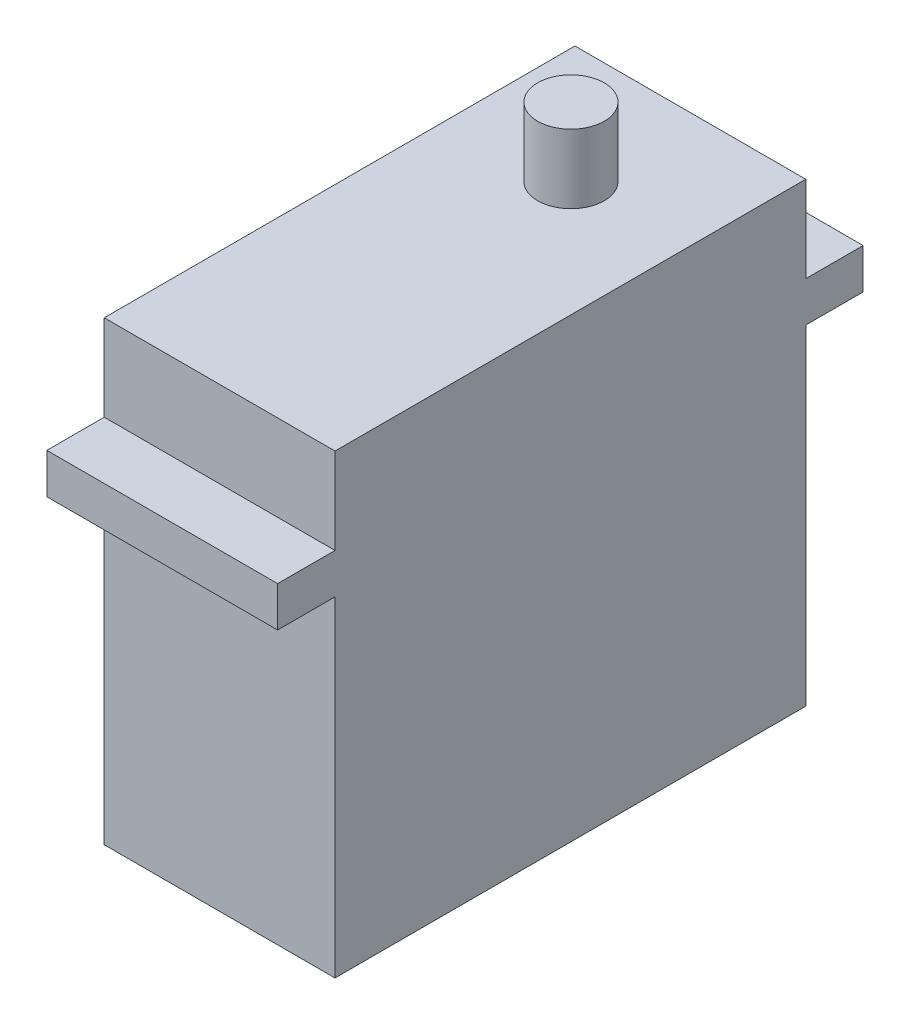
ISO-10303-21;
HEADER;
FILE_DESCRIPTION(('STEP AP214'),'2;1');
FILE_NAME('part.step','',(''),(''),'','','');
FILE_SCHEMA(('AUTOMOTIVE_DESIGN { 1 0 10303 214 1 1 1 1 }'));
ENDSEC;
DATA;
#1=APPLICATION_CONTEXT('core data for automotive mechanical design processes');
#2=APPLICATION_PROTOCOL_DEFINITION('international standard','automotive_design',2000,#1);
#3=PRODUCT_CONTEXT('',#1,'mechanical');
#4=PRODUCT('Part','Part','',(#3));
#5=PRODUCT_RELATED_PRODUCT_CATEGORY('part','',(#4));
#6=PRODUCT_DEFINITION_FORMATION('','',#4);
#7=PRODUCT_DEFINITION_CONTEXT('part definition',#1,'design');
#8=PRODUCT_DEFINITION('design','',#6,#7);
#9=PRODUCT_DEFINITION_SHAPE('','',#8);
#10=(LENGTH_UNIT() NAMED_UNIT(*) SI_UNIT(.MILLI.,.METRE.));
#11=(NAMED_UNIT(*) PLANE_ANGLE_UNIT() SI_UNIT($,.RADIAN.));
#12=(NAMED_UNIT(*) SI_UNIT($,.STERADIAN.) SOLID_ANGLE_UNIT());
#13=UNCERTAINTY_MEASURE_WITH_UNIT(LENGTH_MEASURE(1.E-05),#10,'distance_accuracy_value','');
#14=(GEOMETRIC_REPRESENTATION_CONTEXT(3) GLOBAL_UNCERTAINTY_ASSIGNED_CONTEXT((#13)) GLOBAL_UNIT_ASSIGNED_CONTEXT((#10,
#11,#12)) REPRESENTATION_CONTEXT('',''));
#15=CARTESIAN_POINT('',(0.,0.,0.));
#16=DIRECTION('',(0.,0.,1.));
#17=DIRECTION('',(1.,0.,0.));
#18=AXIS2_PLACEMENT_3D('',#15,#16,#17);
#19=CARTESIAN_POINT('',(20.1,0.,0.));
#20=DIRECTION('',(1.,0.,0.));
#21=DIRECTION('',(0.,0.,-1.));
#22=AXIS2_PLACEMENT_3D('',#19,#20,#21);
#23=PLANE('',#22);
#24=DIRECTION('',(0.,0.,-1.));
#25=VECTOR('',#24,1.);
#26=CARTESIAN_POINT('',(20.1,19.875,0.));
#27=LINE('',#26,#25);
#28=CARTESIAN_POINT('',(20.1,19.875,20.5));
#29=VERTEX_POINT('',#28);
#30=CARTESIAN_POINT('',(20.1,19.875,-20.5));
#31=VERTEX_POINT('',#30);
#32=EDGE_CURVE('E234',#29,#31,#27,.T.);
#33=ORIENTED_EDGE('',*,*,#32,.F.);
#34=DIRECTION('',(0.,-1.,0.));
#35=VECTOR('',#34,1.);
#36=CARTESIAN_POINT('',(20.1,0.,20.5));
#37=LINE('',#36,#35);
#38=CARTESIAN_POINT('',(20.1,12.375,20.5));
#39=VERTEX_POINT('',#38);
#40=EDGE_CURVE('E225',#29,#39,#37,.T.);
#41=ORIENTED_EDGE('',*,*,#40,.T.);
#42=DIRECTION('',(0.,0.,1.));
#43=VECTOR('',#42,1.);
#44=CARTESIAN_POINT('',(20.1,12.375,0.));
#45=LINE('',#44,#43);
#46=CARTESIAN_POINT('',(20.1,12.375,25.5));
#47=VERTEX_POINT('',#46);
#48=EDGE_CURVE('E301',#39,#47,#45,.T.);
#49=ORIENTED_EDGE('',*,*,#48,.T.);
#50=DIRECTION('',(0.,-1.,0.));
#51=VECTOR('',#50,1.);
#52=CARTESIAN_POINT('',(20.1,0.,25.5));
#53=LINE('',#52,#51);
#54=CARTESIAN_POINT('',(20.1,8.87500000000001,25.5));
#55=VERTEX_POINT('',#54);
#56=EDGE_CURVE('E297',#47,#55,#53,.T.);
#57=ORIENTED_EDGE('',*,*,#56,.T.);
#58=DIRECTION('',(0.,0.,1.));
#59=VECTOR('',#58,1.);
#60=CARTESIAN_POINT('',(20.1,8.87500000000004,0.));
#61=LINE('',#60,#59);
#62=CARTESIAN_POINT('',(20.1,8.87500000000001,20.5));
#63=VERTEX_POINT('',#62);
#64=EDGE_CURVE('E291',#63,#55,#61,.T.);
#65=ORIENTED_EDGE('',*,*,#64,.F.);
#66=CARTESIAN_POINT('',(20.1,-19.875,20.5));
#67=VERTEX_POINT('',#66);
#68=EDGE_CURVE('E286',#63,#67,#37,.T.);
#69=ORIENTED_EDGE('',*,*,#68,.T.);
#70=DIRECTION('',(0.,0.,-1.));
#71=VECTOR('',#70,1.);
#72=CARTESIAN_POINT('',(20.1,-19.875,0.));
#73=LINE('',#72,#71);
#74=CARTESIAN_POINT('',(20.1,-19.875,-20.5));
#75=VERTEX_POINT('',#74);
#76=EDGE_CURVE('E283',#67,#75,#73,.T.);
#77=ORIENTED_EDGE('',*,*,#76,.T.);
#78=DIRECTION('',(0.,-1.,0.));
#79=VECTOR('',#78,1.);
#80=CARTESIAN_POINT('',(20.1,0.,-20.5));
#81=LINE('',#80,#79);
#82=CARTESIAN_POINT('',(20.1,8.87500000000001,-20.5));
#83=VERTEX_POINT('',#82);
#84=EDGE_CURVE('E157',#83,#75,#81,.T.);
#85=ORIENTED_EDGE('',*,*,#84,.F.);
#86=DIRECTION('',(0.,0.,-1.));
#87=VECTOR('',#86,1.);
#88=CARTESIAN_POINT('',(20.1,8.87500000000004,0.));
#89=LINE('',#88,#87);
#90=CARTESIAN_POINT('',(20.1,8.87500000000001,-25.5));
#91=VERTEX_POINT('',#90);
#92=EDGE_CURVE('E151',#83,#91,#89,.T.);
#93=ORIENTED_EDGE('',*,*,#92,.T.);
#94=DIRECTION('',(0.,-1.,0.));
#95=VECTOR('',#94,1.);
#96=CARTESIAN_POINT('',(20.1,0.,-25.5));
#97=LINE('',#96,#95);
#98=CARTESIAN_POINT('',(20.1,12.375,-25.5));
#99=VERTEX_POINT('',#98);
#100=EDGE_CURVE('E155',#99,#91,#97,.T.);
#101=ORIENTED_EDGE('',*,*,#100,.F.);
#102=DIRECTION('',(0.,0.,-1.));
#103=VECTOR('',#102,1.);
#104=CARTESIAN_POINT('',(20.1,12.375,0.));
#105=LINE('',#104,#103);
#106=CARTESIAN_POINT('',(20.1,12.375,-20.5));
#107=VERTEX_POINT('',#106);
#108=EDGE_CURVE('E170',#107,#99,#105,.T.);
#109=ORIENTED_EDGE('',*,*,#108,.F.);
#110=EDGE_CURVE('E201',#31,#107,#81,.T.);
#111=ORIENTED_EDGE('',*,*,#110,.F.);
#112=EDGE_LOOP('',(#33,#41,#49,#57,#65,#69,#77,#85,#93,#101,#109,#111));
#113=FACE_BOUND('',#112,.T.);
#114=ADVANCED_FACE('F58',(#113),#23,.T.);
#115=CARTESIAN_POINT('',(20.1,25.875,0.));
#116=DIRECTION('',(0.,1.,0.));
#117=DIRECTION('',(0.,0.,1.));
#118=AXIS2_PLACEMENT_3D('',#115,#116,#117);
#119=PLANE('',#118);
#120=CARTESIAN_POINT('',(10.05,25.875,-10.1));
#121=DIRECTION('',(0.,1.,0.));
#122=DIRECTION('',(0.,0.,1.));
#123=AXIS2_PLACEMENT_3D('',#120,#121,#122);
#124=CIRCLE('',#123,2.9);
#125=CARTESIAN_POINT('',(10.05,25.875,-7.19999999999999));
#126=VERTEX_POINT('',#125);
#127=EDGE_CURVE('E178',#126,#126,#124,.T.);
#128=ORIENTED_EDGE('',*,*,#127,.T.);
#129=EDGE_LOOP('',(#128));
#130=FACE_BOUND('',#129,.T.);
#131=ADVANCED_FACE('F60',(#130),#119,.T.);
#132=CARTESIAN_POINT('',(0.,0.,0.));
#133=DIRECTION('',(1.,0.,0.));
#134=DIRECTION('',(0.,0.,-1.));
#135=AXIS2_PLACEMENT_3D('',#132,#133,#134);
#136=PLANE('',#135);
#137=DIRECTION('',(0.,0.,-1.));
#138=VECTOR('',#137,1.);
#139=CARTESIAN_POINT('',(0.,19.875,0.));
#140=LINE('',#139,#138);
#141=CARTESIAN_POINT('',(0.,19.875,20.5));
#142=VERTEX_POINT('',#141);
#143=CARTESIAN_POINT('',(0.,19.875,-20.5));
#144=VERTEX_POINT('',#143);
#145=EDGE_CURVE('E177',#142,#144,#140,.T.);
#146=ORIENTED_EDGE('',*,*,#145,.T.);
#147=DIRECTION('',(0.,-1.,0.));
#148=VECTOR('',#147,1.);
#149=CARTESIAN_POINT('',(0.,0.,-20.5));
#150=LINE('',#149,#148);
#151=CARTESIAN_POINT('',(0.,12.375,-20.5));
#152=VERTEX_POINT('',#151);
#153=EDGE_CURVE('E175',#144,#152,#150,.T.);
#154=ORIENTED_EDGE('',*,*,#153,.T.);
#155=DIRECTION('',(0.,0.,-1.));
#156=VECTOR('',#155,1.);
#157=CARTESIAN_POINT('',(0.,12.375,0.));
#158=LINE('',#157,#156);
#159=CARTESIAN_POINT('',(0.,12.375,-25.5));
#160=VERTEX_POINT('',#159);
#161=EDGE_CURVE('E198',#152,#160,#158,.T.);
#162=ORIENTED_EDGE('',*,*,#161,.T.);
#163=DIRECTION('',(0.,-1.,0.));
#164=VECTOR('',#163,1.);
#165=CARTESIAN_POINT('',(0.,0.,-25.5));
#166=LINE('',#165,#164);
#167=CARTESIAN_POINT('',(0.,8.87500000000001,-25.5));
#168=VERTEX_POINT('',#167);
#169=EDGE_CURVE('E196',#160,#168,#166,.T.);
#170=ORIENTED_EDGE('',*,*,#169,.T.);
#171=DIRECTION('',(0.,0.,-1.));
#172=VECTOR('',#171,1.);
#173=CARTESIAN_POINT('',(0.,8.87500000000004,0.));
#174=LINE('',#173,#172);
#175=CARTESIAN_POINT('',(0.,8.87500000000001,-20.5));
#176=VERTEX_POINT('',#175);
#177=EDGE_CURVE('E164',#176,#168,#174,.T.);
#178=ORIENTED_EDGE('',*,*,#177,.F.);
#179=CARTESIAN_POINT('',(0.,-19.875,-20.5));
#180=VERTEX_POINT('',#179);
#181=EDGE_CURVE('E179',#176,#180,#150,.T.);
#182=ORIENTED_EDGE('',*,*,#181,.T.);
#183=DIRECTION('',(0.,0.,-1.));
#184=VECTOR('',#183,1.);
#185=CARTESIAN_POINT('',(0.,-19.875,0.));
#186=LINE('',#185,#184);
#187=CARTESIAN_POINT('',(0.,-19.875,20.5));
#188=VERTEX_POINT('',#187);
#189=EDGE_CURVE('E192',#188,#180,#186,.T.);
#190=ORIENTED_EDGE('',*,*,#189,.F.);
#191=DIRECTION('',(0.,-1.,0.));
#192=VECTOR('',#191,1.);
#193=CARTESIAN_POINT('',(0.,0.,20.5));
#194=LINE('',#193,#192);
#195=CARTESIAN_POINT('',(0.,8.87500000000001,20.5));
#196=VERTEX_POINT('',#195);
#197=EDGE_CURVE('E184',#196,#188,#194,.T.);
#198=ORIENTED_EDGE('',*,*,#197,.F.);
#199=DIRECTION('',(0.,0.,1.));
#200=VECTOR('',#199,1.);
#201=CARTESIAN_POINT('',(0.,8.87500000000004,0.));
#202=LINE('',#201,#200);
#203=CARTESIAN_POINT('',(0.,8.87500000000001,25.5));
#204=VERTEX_POINT('',#203);
#205=EDGE_CURVE('E189',#196,#204,#202,.T.);
#206=ORIENTED_EDGE('',*,*,#205,.T.);
#207=DIRECTION('',(0.,-1.,0.));
#208=VECTOR('',#207,1.);
#209=CARTESIAN_POINT('',(0.,0.,25.5));
#210=LINE('',#209,#208);
#211=CARTESIAN_POINT('',(0.,12.375,25.5));
#212=VERTEX_POINT('',#211);
#213=EDGE_CURVE('E186',#212,#204,#210,.T.);
#214=ORIENTED_EDGE('',*,*,#213,.F.);
#215=DIRECTION('',(0.,0.,1.));
#216=VECTOR('',#215,1.);
#217=CARTESIAN_POINT('',(0.,12.375,0.));
#218=LINE('',#217,#216);
#219=CARTESIAN_POINT('',(0.,12.375,20.5));
#220=VERTEX_POINT('',#219);
#221=EDGE_CURVE('E183',#220,#212,#218,.T.);
#222=ORIENTED_EDGE('',*,*,#221,.F.);
#223=EDGE_CURVE('E181',#142,#220,#194,.T.);
#224=ORIENTED_EDGE('',*,*,#223,.F.);
#225=EDGE_LOOP('',(#146,#154,#162,#170,#178,#182,#190,#198,#206,#214,#222,#224));
#226=FACE_BOUND('',#225,.T.);
#227=ADVANCED_FACE('F231',(#226),#136,.F.);
#228=CARTESIAN_POINT('',(20.1,0.,-20.5));
#229=DIRECTION('',(0.,0.,-1.));
#230=DIRECTION('',(0.,1.,0.));
#231=AXIS2_PLACEMENT_3D('',#228,#229,#230);
#232=PLANE('',#231);
#233=ORIENTED_EDGE('',*,*,#153,.F.);
#234=DIRECTION('',(-1.,0.,0.));
#235=VECTOR('',#234,1.);
#236=CARTESIAN_POINT('',(20.1,19.875,-20.5));
#237=LINE('',#236,#235);
#238=EDGE_CURVE('E12',#31,#144,#237,.T.);
#239=ORIENTED_EDGE('',*,*,#238,.F.);
#240=ORIENTED_EDGE('',*,*,#110,.T.);
#241=DIRECTION('',(-1.,0.,0.));
#242=VECTOR('',#241,1.);
#243=CARTESIAN_POINT('',(20.1,12.375,-20.5));
#244=LINE('',#243,#242);
#245=EDGE_CURVE('E75',#107,#152,#244,.T.);
#246=ORIENTED_EDGE('',*,*,#245,.T.);
#247=EDGE_LOOP('',(#233,#239,#240,#246));
#248=FACE_BOUND('',#247,.T.);
#249=ADVANCED_FACE('F235',(#248),#232,.T.);
#250=CARTESIAN_POINT('',(20.1,19.875,0.));
#251=DIRECTION('',(0.,1.,0.));
#252=DIRECTION('',(0.,0.,1.));
#253=AXIS2_PLACEMENT_3D('',#250,#251,#252);
#254=PLANE('',#253);
#255=CARTESIAN_POINT('',(10.05,19.875,-10.1));
#256=DIRECTION('',(0.,1.,0.));
#257=DIRECTION('',(0.,0.,1.));
#258=AXIS2_PLACEMENT_3D('',#255,#256,#257);
#259=CIRCLE('',#258,2.9);
#260=CARTESIAN_POINT('',(10.05,19.875,-7.19999999999999));
#261=VERTEX_POINT('',#260);
#262=EDGE_CURVE('E311',#261,#261,#259,.T.);
#263=ORIENTED_EDGE('',*,*,#262,.F.);
#264=EDGE_LOOP('',(#263));
#265=FACE_BOUND('',#264,.T.);
#266=ORIENTED_EDGE('',*,*,#145,.F.);
#267=DIRECTION('',(-1.,0.,0.));
#268=VECTOR('',#267,1.);
#269=CARTESIAN_POINT('',(20.1,19.875,20.5));
#270=LINE('',#269,#268);
#271=EDGE_CURVE('E67',#29,#142,#270,.T.);
#272=ORIENTED_EDGE('',*,*,#271,.F.);
#273=ORIENTED_EDGE('',*,*,#32,.T.);
#274=ORIENTED_EDGE('',*,*,#238,.T.);
#275=EDGE_LOOP('',(#266,#272,#273,#274));
#276=FACE_BOUND('',#275,.T.);
#277=ADVANCED_FACE('F233',(#265,#276),#254,.T.);
#278=CARTESIAN_POINT('',(20.1,0.,20.5));
#279=DIRECTION('',(0.,0.,-1.));
#280=DIRECTION('',(0.,1.,0.));
#281=AXIS2_PLACEMENT_3D('',#278,#279,#280);
#282=PLANE('',#281);
#283=ORIENTED_EDGE('',*,*,#223,.T.);
#284=DIRECTION('',(-1.,0.,0.));
#285=VECTOR('',#284,1.);
#286=CARTESIAN_POINT('',(20.1,12.375,20.5));
#287=LINE('',#286,#285);
#288=EDGE_CURVE('E217',#39,#220,#287,.T.);
#289=ORIENTED_EDGE('',*,*,#288,.F.);
#290=ORIENTED_EDGE('',*,*,#40,.F.);
#291=ORIENTED_EDGE('',*,*,#271,.T.);
#292=EDGE_LOOP('',(#283,#289,#290,#291));
#293=FACE_BOUND('',#292,.T.);
#294=ADVANCED_FACE('F223',(#293),#282,.F.);
#295=CARTESIAN_POINT('',(20.1,12.375,0.));
#296=DIRECTION('',(0.,-1.,0.));
#297=DIRECTION('',(0.,0.,-1.));
#298=AXIS2_PLACEMENT_3D('',#295,#296,#297);
#299=PLANE('',#298);
#300=ORIENTED_EDGE('',*,*,#221,.T.);
#301=DIRECTION('',(-1.,0.,0.));
#302=VECTOR('',#301,1.);
#303=CARTESIAN_POINT('',(20.1,12.375,25.5));
#304=LINE('',#303,#302);
#305=EDGE_CURVE('E214',#47,#212,#304,.T.);
#306=ORIENTED_EDGE('',*,*,#305,.F.);
#307=ORIENTED_EDGE('',*,*,#48,.F.);
#308=ORIENTED_EDGE('',*,*,#288,.T.);
#309=EDGE_LOOP('',(#300,#306,#307,#308));
#310=FACE_BOUND('',#309,.T.);
#311=ADVANCED_FACE('F300',(#310),#299,.F.);
#312=CARTESIAN_POINT('',(20.1,0.,25.5));
#313=DIRECTION('',(0.,0.,-1.));
#314=DIRECTION('',(-1.,0.,0.));
#315=AXIS2_PLACEMENT_3D('',#312,#313,#314);
#316=PLANE('',#315);
#317=ORIENTED_EDGE('',*,*,#213,.T.);
#318=DIRECTION('',(-1.,0.,0.));
#319=VECTOR('',#318,1.);
#320=CARTESIAN_POINT('',(20.1,8.87500000000001,25.5));
#321=LINE('',#320,#319);
#322=EDGE_CURVE('E212',#55,#204,#321,.T.);
#323=ORIENTED_EDGE('',*,*,#322,.F.);
#324=ORIENTED_EDGE('',*,*,#56,.F.);
#325=ORIENTED_EDGE('',*,*,#305,.T.);
#326=EDGE_LOOP('',(#317,#323,#324,#325));
#327=FACE_BOUND('',#326,.T.);
#328=ADVANCED_FACE('F294',(#327),#316,.F.);
#329=CARTESIAN_POINT('',(20.1,8.87500000000004,0.));
#330=DIRECTION('',(0.,-1.,0.));
#331=DIRECTION('',(0.,0.,-1.));
#332=AXIS2_PLACEMENT_3D('',#329,#330,#331);
#333=PLANE('',#332);
#334=ORIENTED_EDGE('',*,*,#205,.F.);
#335=DIRECTION('',(-1.,0.,0.));
#336=VECTOR('',#335,1.);
#337=CARTESIAN_POINT('',(20.1,8.87500000000001,20.5));
#338=LINE('',#337,#336);
#339=EDGE_CURVE('E210',#63,#196,#338,.T.);
#340=ORIENTED_EDGE('',*,*,#339,.F.);
#341=ORIENTED_EDGE('',*,*,#64,.T.);
#342=ORIENTED_EDGE('',*,*,#322,.T.);
#343=EDGE_LOOP('',(#334,#340,#341,#342));
#344=FACE_BOUND('',#343,.T.);
#345=ADVANCED_FACE('F290',(#344),#333,.T.);
#346=ORIENTED_EDGE('',*,*,#197,.T.);
#347=DIRECTION('',(-1.,0.,0.));
#348=VECTOR('',#347,1.);
#349=CARTESIAN_POINT('',(20.1,-19.875,20.5));
#350=LINE('',#349,#348);
#351=EDGE_CURVE('E207',#67,#188,#350,.T.);
#352=ORIENTED_EDGE('',*,*,#351,.F.);
#353=ORIENTED_EDGE('',*,*,#68,.F.);
#354=ORIENTED_EDGE('',*,*,#339,.T.);
#355=EDGE_LOOP('',(#346,#352,#353,#354));
#356=FACE_BOUND('',#355,.T.);
#357=ADVANCED_FACE('F273',(#356),#282,.F.);
#358=CARTESIAN_POINT('',(20.1,-19.875,0.));
#359=DIRECTION('',(0.,1.,0.));
#360=DIRECTION('',(0.,0.,1.));
#361=AXIS2_PLACEMENT_3D('',#358,#359,#360);
#362=PLANE('',#361);
#363=ORIENTED_EDGE('',*,*,#189,.T.);
#364=DIRECTION('',(-1.,0.,0.));
#365=VECTOR('',#364,1.);
#366=CARTESIAN_POINT('',(20.1,-19.875,-20.5));
#367=LINE('',#366,#365);
#368=EDGE_CURVE('E205',#75,#180,#367,.T.);
#369=ORIENTED_EDGE('',*,*,#368,.F.);
#370=ORIENTED_EDGE('',*,*,#76,.F.);
#371=ORIENTED_EDGE('',*,*,#351,.T.);
#372=EDGE_LOOP('',(#363,#369,#370,#371));
#373=FACE_BOUND('',#372,.T.);
#374=ADVANCED_FACE('F267',(#373),#362,.F.);
#375=ORIENTED_EDGE('',*,*,#181,.F.);
#376=DIRECTION('',(-1.,0.,0.));
#377=VECTOR('',#376,1.);
#378=CARTESIAN_POINT('',(20.1,8.87500000000001,-20.5));
#379=LINE('',#378,#377);
#380=EDGE_CURVE('E167',#83,#176,#379,.T.);
#381=ORIENTED_EDGE('',*,*,#380,.F.);
#382=ORIENTED_EDGE('',*,*,#84,.T.);
#383=ORIENTED_EDGE('',*,*,#368,.T.);
#384=EDGE_LOOP('',(#375,#381,#382,#383));
#385=FACE_BOUND('',#384,.T.);
#386=ADVANCED_FACE('F259',(#385),#232,.T.);
#387=CARTESIAN_POINT('',(20.1,8.87500000000004,0.));
#388=DIRECTION('',(0.,1.,0.));
#389=DIRECTION('',(0.,0.,1.));
#390=AXIS2_PLACEMENT_3D('',#387,#388,#389);
#391=PLANE('',#390);
#392=ORIENTED_EDGE('',*,*,#177,.T.);
#393=DIRECTION('',(-1.,0.,0.));
#394=VECTOR('',#393,1.);
#395=CARTESIAN_POINT('',(20.1,8.87500000000001,-25.5));
#396=LINE('',#395,#394);
#397=EDGE_CURVE('E161',#91,#168,#396,.T.);
#398=ORIENTED_EDGE('',*,*,#397,.F.);
#399=ORIENTED_EDGE('',*,*,#92,.F.);
#400=ORIENTED_EDGE('',*,*,#380,.T.);
#401=EDGE_LOOP('',(#392,#398,#399,#400));
#402=FACE_BOUND('',#401,.T.);
#403=ADVANCED_FACE('F162',(#402),#391,.F.);
#404=CARTESIAN_POINT('',(20.1,0.,-25.5));
#405=DIRECTION('',(0.,0.,-1.));
#406=DIRECTION('',(-1.,0.,0.));
#407=AXIS2_PLACEMENT_3D('',#404,#405,#406);
#408=PLANE('',#407);
#409=ORIENTED_EDGE('',*,*,#169,.F.);
#410=DIRECTION('',(-1.,0.,0.));
#411=VECTOR('',#410,1.);
#412=CARTESIAN_POINT('',(20.1,12.375,-25.5));
#413=LINE('',#412,#411);
#414=EDGE_CURVE('E113',#99,#160,#413,.T.);
#415=ORIENTED_EDGE('',*,*,#414,.F.);
#416=ORIENTED_EDGE('',*,*,#100,.T.);
#417=ORIENTED_EDGE('',*,*,#397,.T.);
#418=EDGE_LOOP('',(#409,#415,#416,#417));
#419=FACE_BOUND('',#418,.T.);
#420=ADVANCED_FACE('F169',(#419),#408,.T.);
#421=CARTESIAN_POINT('',(20.1,12.375,0.));
#422=DIRECTION('',(0.,1.,0.));
#423=DIRECTION('',(0.,0.,1.));
#424=AXIS2_PLACEMENT_3D('',#421,#422,#423);
#425=PLANE('',#424);
#426=ORIENTED_EDGE('',*,*,#161,.F.);
#427=ORIENTED_EDGE('',*,*,#245,.F.);
#428=ORIENTED_EDGE('',*,*,#108,.T.);
#429=ORIENTED_EDGE('',*,*,#414,.T.);
#430=EDGE_LOOP('',(#426,#427,#428,#429));
#431=FACE_BOUND('',#430,.T.);
#432=ADVANCED_FACE('F236',(#431),#425,.T.);
#433=CARTESIAN_POINT('',(10.05,37.4785554895902,-10.1));
#434=DIRECTION('',(0.,-1.,0.));
#435=DIRECTION('',(0.,0.,-1.));
#436=AXIS2_PLACEMENT_3D('',#433,#434,#435);
#437=CYLINDRICAL_SURFACE('',#436,2.9);
#438=ORIENTED_EDGE('',*,*,#262,.T.);
#439=EDGE_LOOP('',(#438));
#440=FACE_BOUND('',#439,.T.);
#441=ORIENTED_EDGE('',*,*,#127,.F.);
#442=EDGE_LOOP('',(#441));
#443=FACE_BOUND('',#442,.T.);
#444=ADVANCED_FACE('F238',(#440,#443),#437,.T.);
#445=CLOSED_SHELL('',(#114,#131,#227,#249,#277,#294,#311,#328,#345,#357,#374,#386,#403,#420,
#432,#444));
#446=MANIFOLD_SOLID_BREP('B2',#445);
#447=ADVANCED_BREP_SHAPE_REPRESENTATION('',(#18,#446),#14);
#448=SHAPE_DEFINITION_REPRESENTATION(#9,#447);
ENDSEC;
END-ISO-10303-21;
